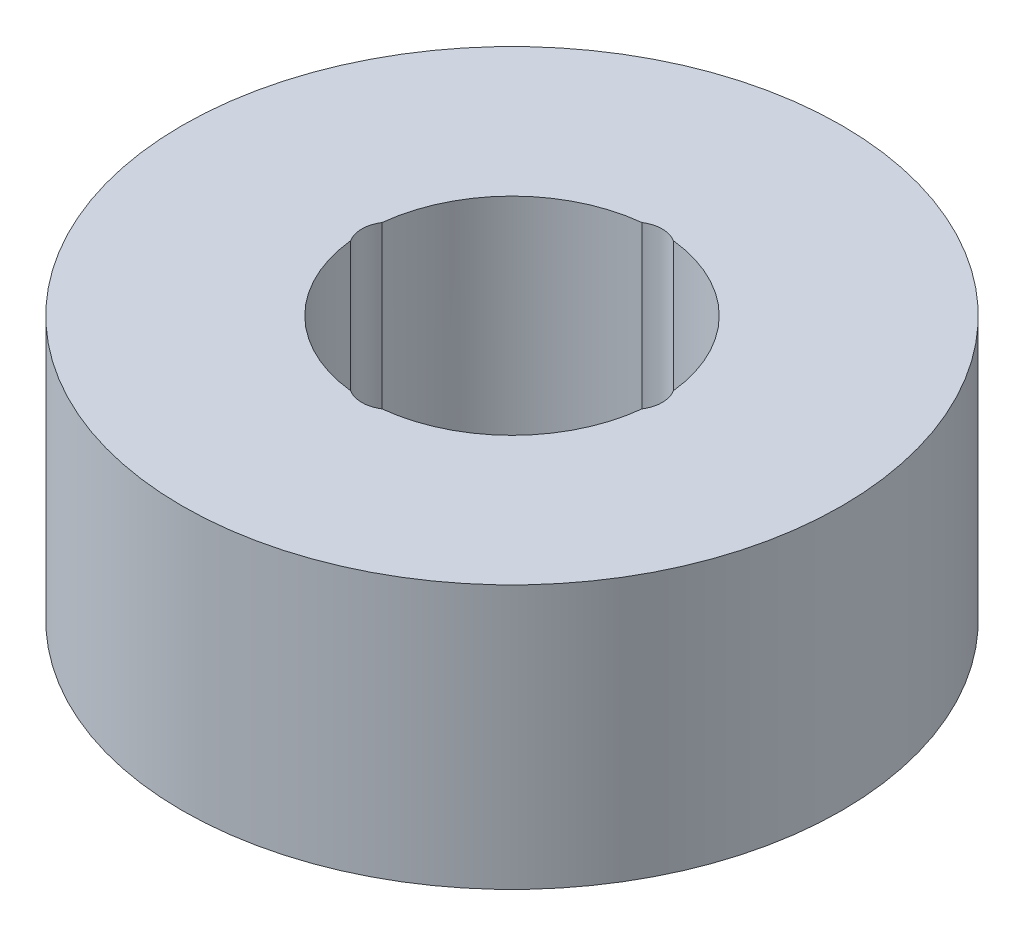
ISO-10303-21;
HEADER;
FILE_DESCRIPTION(('STEP AP214'),'2;1');
FILE_NAME('part.step','',(''),(''),'','','');
FILE_SCHEMA(('AUTOMOTIVE_DESIGN { 1 0 10303 214 1 1 1 1 }'));
ENDSEC;
DATA;
#1=APPLICATION_CONTEXT('core data for automotive mechanical design processes');
#2=APPLICATION_PROTOCOL_DEFINITION('international standard','automotive_design',2000,#1);
#3=PRODUCT_CONTEXT('',#1,'mechanical');
#4=PRODUCT('Part','Part','',(#3));
#5=PRODUCT_RELATED_PRODUCT_CATEGORY('part','',(#4));
#6=PRODUCT_DEFINITION_FORMATION('','',#4);
#7=PRODUCT_DEFINITION_CONTEXT('part definition',#1,'design');
#8=PRODUCT_DEFINITION('design','',#6,#7);
#9=PRODUCT_DEFINITION_SHAPE('','',#8);
#10=(LENGTH_UNIT() NAMED_UNIT(*) SI_UNIT(.MILLI.,.METRE.));
#11=(NAMED_UNIT(*) PLANE_ANGLE_UNIT() SI_UNIT($,.RADIAN.));
#12=(NAMED_UNIT(*) SI_UNIT($,.STERADIAN.) SOLID_ANGLE_UNIT());
#13=UNCERTAINTY_MEASURE_WITH_UNIT(LENGTH_MEASURE(1.E-05),#10,'distance_accuracy_value','');
#14=(GEOMETRIC_REPRESENTATION_CONTEXT(3) GLOBAL_UNCERTAINTY_ASSIGNED_CONTEXT((#13)) GLOBAL_UNIT_ASSIGNED_CONTEXT((#10,
#11,#12)) REPRESENTATION_CONTEXT('',''));
#15=CARTESIAN_POINT('',(0.,0.,0.));
#16=DIRECTION('',(0.,0.,1.));
#17=DIRECTION('',(1.,0.,0.));
#18=AXIS2_PLACEMENT_3D('',#15,#16,#17);
#19=CARTESIAN_POINT('',(0.,18.,0.));
#20=DIRECTION('',(0.,-1.,0.));
#21=DIRECTION('',(0.,0.,-1.));
#22=AXIS2_PLACEMENT_3D('',#19,#20,#21);
#23=CYLINDRICAL_SURFACE('',#22,22.5);
#24=CARTESIAN_POINT('',(0.,18.,0.));
#25=DIRECTION('',(0.,1.,0.));
#26=DIRECTION('',(0.,0.,1.));
#27=AXIS2_PLACEMENT_3D('',#24,#25,#26);
#28=CIRCLE('',#27,22.5);
#29=CARTESIAN_POINT('',(0.,18.,22.5));
#30=VERTEX_POINT('',#29);
#31=EDGE_CURVE('E148',#30,#30,#28,.T.);
#32=ORIENTED_EDGE('',*,*,#31,.F.);
#33=EDGE_LOOP('',(#32));
#34=FACE_BOUND('',#33,.T.);
#35=CARTESIAN_POINT('',(0.,0.,0.));
#36=DIRECTION('',(0.,1.,0.));
#37=DIRECTION('',(0.,0.,1.));
#38=AXIS2_PLACEMENT_3D('',#35,#36,#37);
#39=CIRCLE('',#38,22.5);
#40=CARTESIAN_POINT('',(0.,0.,22.5));
#41=VERTEX_POINT('',#40);
#42=EDGE_CURVE('E139',#41,#41,#39,.T.);
#43=ORIENTED_EDGE('',*,*,#42,.T.);
#44=EDGE_LOOP('',(#43));
#45=FACE_BOUND('',#44,.T.);
#46=ADVANCED_FACE('F39',(#34,#45),#23,.T.);
#47=CARTESIAN_POINT('',(0.,18.,0.));
#48=DIRECTION('',(0.,1.,0.));
#49=DIRECTION('',(0.,0.,1.));
#50=AXIS2_PLACEMENT_3D('',#47,#48,#49);
#51=PLANE('',#50);
#52=CARTESIAN_POINT('',(0.,18.,8.25590758421927));
#53=DIRECTION('',(0.,1.,0.));
#54=DIRECTION('',(1.,0.,0.));
#55=AXIS2_PLACEMENT_3D('',#52,#53,#54);
#56=CIRCLE('',#55,1.99835433427983);
#57=CARTESIAN_POINT('',(-1.07203622196934,18.,9.94237086105652));
#58=VERTEX_POINT('',#57);
#59=CARTESIAN_POINT('',(1.07203622196941,18.,9.94237086105651));
#60=VERTEX_POINT('',#59);
#61=EDGE_CURVE('E175',#58,#60,#56,.T.);
#62=ORIENTED_EDGE('',*,*,#61,.F.);
#63=CARTESIAN_POINT('',(0.,18.,0.));
#64=DIRECTION('',(0.,1.,0.));
#65=DIRECTION('',(0.,0.,1.));
#66=AXIS2_PLACEMENT_3D('',#63,#64,#65);
#67=CIRCLE('',#66,10.);
#68=CARTESIAN_POINT('',(-9.94237086105651,18.,1.07203622196937));
#69=VERTEX_POINT('',#68);
#70=EDGE_CURVE('E134',#69,#58,#67,.T.);
#71=ORIENTED_EDGE('',*,*,#70,.F.);
#72=CARTESIAN_POINT('',(-8.25590758421927,18.,0.));
#73=DIRECTION('',(0.,1.,0.));
#74=DIRECTION('',(0.,0.,1.));
#75=AXIS2_PLACEMENT_3D('',#72,#73,#74);
#76=CIRCLE('',#75,1.99835433427983);
#77=CARTESIAN_POINT('',(-9.94237086105651,18.,-1.07203622196937));
#78=VERTEX_POINT('',#77);
#79=EDGE_CURVE('E143',#78,#69,#76,.T.);
#80=ORIENTED_EDGE('',*,*,#79,.F.);
#81=CARTESIAN_POINT('',(-1.07203622196948,18.,-9.9423708610565));
#82=VERTEX_POINT('',#81);
#83=EDGE_CURVE('E123',#82,#78,#67,.T.);
#84=ORIENTED_EDGE('',*,*,#83,.F.);
#85=CARTESIAN_POINT('',(0.,18.,-8.25590758421927));
#86=DIRECTION('',(0.,1.,0.));
#87=DIRECTION('',(-1.,0.,0.));
#88=AXIS2_PLACEMENT_3D('',#85,#86,#87);
#89=CIRCLE('',#88,1.99835433427983);
#90=CARTESIAN_POINT('',(1.07203622196927,18.,-9.94237086105652));
#91=VERTEX_POINT('',#90);
#92=EDGE_CURVE('E106',#91,#82,#89,.T.);
#93=ORIENTED_EDGE('',*,*,#92,.F.);
#94=CARTESIAN_POINT('',(9.94237086105651,18.,-1.07203622196937));
#95=VERTEX_POINT('',#94);
#96=EDGE_CURVE('E125',#95,#91,#67,.T.);
#97=ORIENTED_EDGE('',*,*,#96,.F.);
#98=CARTESIAN_POINT('',(8.25590758421927,18.,0.));
#99=DIRECTION('',(0.,1.,0.));
#100=DIRECTION('',(0.,0.,-1.));
#101=AXIS2_PLACEMENT_3D('',#98,#99,#100);
#102=CIRCLE('',#101,1.99835433427983);
#103=CARTESIAN_POINT('',(9.94237086105651,18.,1.07203622196937));
#104=VERTEX_POINT('',#103);
#105=EDGE_CURVE('E286',#104,#95,#102,.T.);
#106=ORIENTED_EDGE('',*,*,#105,.F.);
#107=EDGE_CURVE('E135',#60,#104,#67,.T.);
#108=ORIENTED_EDGE('',*,*,#107,.F.);
#109=EDGE_LOOP('',(#62,#71,#80,#84,#93,#97,#106,#108));
#110=FACE_BOUND('',#109,.T.);
#111=ORIENTED_EDGE('',*,*,#31,.T.);
#112=EDGE_LOOP('',(#111));
#113=FACE_BOUND('',#112,.T.);
#114=ADVANCED_FACE('F118',(#110,#113),#51,.T.);
#115=CARTESIAN_POINT('',(0.,0.,0.));
#116=DIRECTION('',(0.,1.,0.));
#117=DIRECTION('',(0.,0.,1.));
#118=AXIS2_PLACEMENT_3D('',#115,#116,#117);
#119=PLANE('',#118);
#120=CARTESIAN_POINT('',(0.,0.,0.));
#121=DIRECTION('',(0.,1.,0.));
#122=DIRECTION('',(0.,0.,1.));
#123=AXIS2_PLACEMENT_3D('',#120,#121,#122);
#124=CIRCLE('',#123,10.);
#125=CARTESIAN_POINT('',(0.,0.,10.));
#126=VERTEX_POINT('',#125);
#127=EDGE_CURVE('E136',#126,#126,#124,.T.);
#128=ORIENTED_EDGE('',*,*,#127,.T.);
#129=EDGE_LOOP('',(#128));
#130=FACE_BOUND('',#129,.T.);
#131=ORIENTED_EDGE('',*,*,#42,.F.);
#132=EDGE_LOOP('',(#131));
#133=FACE_BOUND('',#132,.T.);
#134=ADVANCED_FACE('F187',(#130,#133),#119,.F.);
#135=CARTESIAN_POINT('',(0.,18.,0.));
#136=DIRECTION('',(0.,-1.,0.));
#137=DIRECTION('',(0.,0.,-1.));
#138=AXIS2_PLACEMENT_3D('',#135,#136,#137);
#139=CYLINDRICAL_SURFACE('',#138,10.);
#140=DIRECTION('',(0.,1.,0.));
#141=VECTOR('',#140,1.);
#142=CARTESIAN_POINT('',(-1.07203622196934,10.8588811365714,9.94237086105652));
#143=LINE('',#142,#141);
#144=CARTESIAN_POINT('',(-1.07203622196934,3.71776227314281,9.94237086105652));
#145=VERTEX_POINT('',#144);
#146=EDGE_CURVE('E11',#145,#58,#143,.T.);
#147=ORIENTED_EDGE('',*,*,#146,.F.);
#148=CARTESIAN_POINT('',(0.,3.71776227314281,0.));
#149=DIRECTION('',(0.,1.,0.));
#150=DIRECTION('',(0.,0.,1.));
#151=AXIS2_PLACEMENT_3D('',#148,#149,#150);
#152=CIRCLE('',#151,10.);
#153=CARTESIAN_POINT('',(1.07203622196941,3.71776227314281,9.94237086105651));
#154=VERTEX_POINT('',#153);
#155=EDGE_CURVE('E170',#145,#154,#152,.T.);
#156=ORIENTED_EDGE('',*,*,#155,.T.);
#157=DIRECTION('',(0.,1.,0.));
#158=VECTOR('',#157,1.);
#159=CARTESIAN_POINT('',(1.07203622196941,10.8588811365714,9.94237086105651));
#160=LINE('',#159,#158);
#161=EDGE_CURVE('E46',#60,#154,#160,.F.);
#162=ORIENTED_EDGE('',*,*,#161,.F.);
#163=ORIENTED_EDGE('',*,*,#107,.T.);
#164=DIRECTION('',(0.,1.,0.));
#165=VECTOR('',#164,1.);
#166=CARTESIAN_POINT('',(9.94237086105651,10.8588811365714,1.07203622196937));
#167=LINE('',#166,#165);
#168=CARTESIAN_POINT('',(9.94237086105651,3.71776227314281,1.07203622196937));
#169=VERTEX_POINT('',#168);
#170=EDGE_CURVE('E164',#169,#104,#167,.T.);
#171=ORIENTED_EDGE('',*,*,#170,.F.);
#172=CARTESIAN_POINT('',(0.,3.71776227314281,0.));
#173=DIRECTION('',(0.,1.,0.));
#174=DIRECTION('',(0.,0.,1.));
#175=AXIS2_PLACEMENT_3D('',#172,#173,#174);
#176=CIRCLE('',#175,10.);
#177=CARTESIAN_POINT('',(9.94237086105651,3.71776227314281,-1.07203622196937));
#178=VERTEX_POINT('',#177);
#179=EDGE_CURVE('E115',#169,#178,#176,.T.);
#180=ORIENTED_EDGE('',*,*,#179,.T.);
#181=DIRECTION('',(0.,1.,0.));
#182=VECTOR('',#181,1.);
#183=CARTESIAN_POINT('',(9.94237086105651,10.8588811365714,-1.07203622196937));
#184=LINE('',#183,#182);
#185=EDGE_CURVE('E131',#95,#178,#184,.F.);
#186=ORIENTED_EDGE('',*,*,#185,.F.);
#187=ORIENTED_EDGE('',*,*,#96,.T.);
#188=DIRECTION('',(0.,1.,0.));
#189=VECTOR('',#188,1.);
#190=CARTESIAN_POINT('',(1.07203622196927,10.8588811365714,-9.94237086105652));
#191=LINE('',#190,#189);
#192=CARTESIAN_POINT('',(1.07203622196927,3.71776227314281,-9.94237086105652));
#193=VERTEX_POINT('',#192);
#194=EDGE_CURVE('E105',#193,#91,#191,.T.);
#195=ORIENTED_EDGE('',*,*,#194,.F.);
#196=CARTESIAN_POINT('',(0.,3.71776227314281,0.));
#197=DIRECTION('',(0.,1.,0.));
#198=DIRECTION('',(0.,0.,1.));
#199=AXIS2_PLACEMENT_3D('',#196,#197,#198);
#200=CIRCLE('',#199,10.);
#201=CARTESIAN_POINT('',(-1.07203622196948,3.71776227314281,-9.9423708610565));
#202=VERTEX_POINT('',#201);
#203=EDGE_CURVE('E159',#193,#202,#200,.T.);
#204=ORIENTED_EDGE('',*,*,#203,.T.);
#205=DIRECTION('',(0.,1.,0.));
#206=VECTOR('',#205,1.);
#207=CARTESIAN_POINT('',(-1.07203622196948,10.8588811365714,-9.9423708610565));
#208=LINE('',#207,#206);
#209=EDGE_CURVE('E114',#82,#202,#208,.F.);
#210=ORIENTED_EDGE('',*,*,#209,.F.);
#211=ORIENTED_EDGE('',*,*,#83,.T.);
#212=DIRECTION('',(0.,1.,0.));
#213=VECTOR('',#212,1.);
#214=CARTESIAN_POINT('',(-9.94237086105651,10.8588811365714,-1.07203622196937));
#215=LINE('',#214,#213);
#216=CARTESIAN_POINT('',(-9.94237086105651,3.71776227314281,-1.07203622196937));
#217=VERTEX_POINT('',#216);
#218=EDGE_CURVE('E160',#217,#78,#215,.T.);
#219=ORIENTED_EDGE('',*,*,#218,.F.);
#220=CARTESIAN_POINT('',(0.,3.71776227314281,0.));
#221=DIRECTION('',(0.,1.,0.));
#222=DIRECTION('',(0.,0.,1.));
#223=AXIS2_PLACEMENT_3D('',#220,#221,#222);
#224=CIRCLE('',#223,10.);
#225=CARTESIAN_POINT('',(-9.94237086105651,3.71776227314281,1.07203622196937));
#226=VERTEX_POINT('',#225);
#227=EDGE_CURVE('E149',#217,#226,#224,.T.);
#228=ORIENTED_EDGE('',*,*,#227,.T.);
#229=DIRECTION('',(0.,1.,0.));
#230=VECTOR('',#229,1.);
#231=CARTESIAN_POINT('',(-9.94237086105651,10.8588811365714,1.07203622196937));
#232=LINE('',#231,#230);
#233=EDGE_CURVE('E152',#69,#226,#232,.F.);
#234=ORIENTED_EDGE('',*,*,#233,.F.);
#235=ORIENTED_EDGE('',*,*,#70,.T.);
#236=EDGE_LOOP('',(#147,#156,#162,#163,#171,#180,#186,#187,#195,#204,#210,#211,#219,#228,#234,#235));
#237=FACE_BOUND('',#236,.T.);
#238=ORIENTED_EDGE('',*,*,#127,.F.);
#239=EDGE_LOOP('',(#238));
#240=FACE_BOUND('',#239,.T.);
#241=ADVANCED_FACE('F126',(#237,#240),#139,.F.);
#242=CARTESIAN_POINT('',(-8.25590758421927,3.71776227314281,0.));
#243=DIRECTION('',(0.,1.,0.));
#244=DIRECTION('',(0.,0.,1.));
#245=AXIS2_PLACEMENT_3D('',#242,#243,#244);
#246=CYLINDRICAL_SURFACE('',#245,1.99835433427983);
#247=ORIENTED_EDGE('',*,*,#218,.T.);
#248=ORIENTED_EDGE('',*,*,#79,.T.);
#249=ORIENTED_EDGE('',*,*,#233,.T.);
#250=CARTESIAN_POINT('',(-8.25590758421927,3.71776227314281,0.));
#251=DIRECTION('',(0.,1.,0.));
#252=DIRECTION('',(0.,0.,1.));
#253=AXIS2_PLACEMENT_3D('',#250,#251,#252);
#254=CIRCLE('',#253,1.99835433427983);
#255=EDGE_CURVE('E144',#217,#226,#254,.T.);
#256=ORIENTED_EDGE('',*,*,#255,.F.);
#257=EDGE_LOOP('',(#247,#248,#249,#256));
#258=FACE_BOUND('',#257,.T.);
#259=ADVANCED_FACE('F200',(#258),#246,.F.);
#260=CARTESIAN_POINT('',(-8.25590758421927,3.71776227314281,0.));
#261=DIRECTION('',(0.,1.,0.));
#262=DIRECTION('',(0.,0.,1.));
#263=AXIS2_PLACEMENT_3D('',#260,#261,#262);
#264=PLANE('',#263);
#265=ORIENTED_EDGE('',*,*,#255,.T.);
#266=ORIENTED_EDGE('',*,*,#227,.F.);
#267=EDGE_LOOP('',(#265,#266));
#268=FACE_BOUND('',#267,.T.);
#269=ADVANCED_FACE('F201',(#268),#264,.T.);
#270=CARTESIAN_POINT('',(0.,3.71776227314281,-8.25590758421927));
#271=DIRECTION('',(0.,1.,0.));
#272=DIRECTION('',(0.,0.,1.));
#273=AXIS2_PLACEMENT_3D('',#270,#271,#272);
#274=CYLINDRICAL_SURFACE('',#273,1.99835433427983);
#275=ORIENTED_EDGE('',*,*,#194,.T.);
#276=ORIENTED_EDGE('',*,*,#92,.T.);
#277=ORIENTED_EDGE('',*,*,#209,.T.);
#278=CARTESIAN_POINT('',(0.,3.71776227314281,-8.25590758421927));
#279=DIRECTION('',(0.,1.,0.));
#280=DIRECTION('',(-1.,0.,0.));
#281=AXIS2_PLACEMENT_3D('',#278,#279,#280);
#282=CIRCLE('',#281,1.99835433427983);
#283=EDGE_CURVE('E107',#193,#202,#282,.T.);
#284=ORIENTED_EDGE('',*,*,#283,.F.);
#285=EDGE_LOOP('',(#275,#276,#277,#284));
#286=FACE_BOUND('',#285,.T.);
#287=ADVANCED_FACE('F102',(#286),#274,.F.);
#288=CARTESIAN_POINT('',(0.,3.71776227314281,-8.25590758421927));
#289=DIRECTION('',(0.,1.,0.));
#290=DIRECTION('',(-1.,0.,0.));
#291=AXIS2_PLACEMENT_3D('',#288,#289,#290);
#292=PLANE('',#291);
#293=ORIENTED_EDGE('',*,*,#283,.T.);
#294=ORIENTED_EDGE('',*,*,#203,.F.);
#295=EDGE_LOOP('',(#293,#294));
#296=FACE_BOUND('',#295,.T.);
#297=ADVANCED_FACE('F209',(#296),#292,.T.);
#298=CARTESIAN_POINT('',(8.25590758421927,3.71776227314281,0.));
#299=DIRECTION('',(0.,1.,0.));
#300=DIRECTION('',(0.,0.,1.));
#301=AXIS2_PLACEMENT_3D('',#298,#299,#300);
#302=CYLINDRICAL_SURFACE('',#301,1.99835433427983);
#303=ORIENTED_EDGE('',*,*,#170,.T.);
#304=ORIENTED_EDGE('',*,*,#105,.T.);
#305=ORIENTED_EDGE('',*,*,#185,.T.);
#306=CARTESIAN_POINT('',(8.25590758421927,3.71776227314281,0.));
#307=DIRECTION('',(0.,1.,0.));
#308=DIRECTION('',(0.,0.,-1.));
#309=AXIS2_PLACEMENT_3D('',#306,#307,#308);
#310=CIRCLE('',#309,1.99835433427983);
#311=EDGE_CURVE('E56',#169,#178,#310,.T.);
#312=ORIENTED_EDGE('',*,*,#311,.F.);
#313=EDGE_LOOP('',(#303,#304,#305,#312));
#314=FACE_BOUND('',#313,.T.);
#315=ADVANCED_FACE('F213',(#314),#302,.F.);
#316=CARTESIAN_POINT('',(8.25590758421927,3.71776227314281,0.));
#317=DIRECTION('',(0.,1.,0.));
#318=DIRECTION('',(0.,0.,-1.));
#319=AXIS2_PLACEMENT_3D('',#316,#317,#318);
#320=PLANE('',#319);
#321=ORIENTED_EDGE('',*,*,#311,.T.);
#322=ORIENTED_EDGE('',*,*,#179,.F.);
#323=EDGE_LOOP('',(#321,#322));
#324=FACE_BOUND('',#323,.T.);
#325=ADVANCED_FACE('F179',(#324),#320,.T.);
#326=CARTESIAN_POINT('',(0.,3.71776227314281,8.25590758421927));
#327=DIRECTION('',(0.,1.,0.));
#328=DIRECTION('',(0.,0.,1.));
#329=AXIS2_PLACEMENT_3D('',#326,#327,#328);
#330=CYLINDRICAL_SURFACE('',#329,1.99835433427983);
#331=ORIENTED_EDGE('',*,*,#146,.T.);
#332=ORIENTED_EDGE('',*,*,#61,.T.);
#333=ORIENTED_EDGE('',*,*,#161,.T.);
#334=CARTESIAN_POINT('',(0.,3.71776227314281,8.25590758421927));
#335=DIRECTION('',(0.,1.,0.));
#336=DIRECTION('',(1.,0.,0.));
#337=AXIS2_PLACEMENT_3D('',#334,#335,#336);
#338=CIRCLE('',#337,1.99835433427983);
#339=EDGE_CURVE('E55',#145,#154,#338,.T.);
#340=ORIENTED_EDGE('',*,*,#339,.F.);
#341=EDGE_LOOP('',(#331,#332,#333,#340));
#342=FACE_BOUND('',#341,.T.);
#343=ADVANCED_FACE('F171',(#342),#330,.F.);
#344=CARTESIAN_POINT('',(0.,3.71776227314281,8.25590758421927));
#345=DIRECTION('',(0.,1.,0.));
#346=DIRECTION('',(1.,0.,0.));
#347=AXIS2_PLACEMENT_3D('',#344,#345,#346);
#348=PLANE('',#347);
#349=ORIENTED_EDGE('',*,*,#339,.T.);
#350=ORIENTED_EDGE('',*,*,#155,.F.);
#351=EDGE_LOOP('',(#349,#350));
#352=FACE_BOUND('',#351,.T.);
#353=ADVANCED_FACE('F173',(#352),#348,.T.);
#354=CLOSED_SHELL('',(#46,#114,#134,#241,#259,#269,#287,#297,#315,#325,#343,#353));
#355=MANIFOLD_SOLID_BREP('B2',#354);
#356=ADVANCED_BREP_SHAPE_REPRESENTATION('',(#18,#355),#14);
#357=SHAPE_DEFINITION_REPRESENTATION(#9,#356);
ENDSEC;
END-ISO-10303-21;
